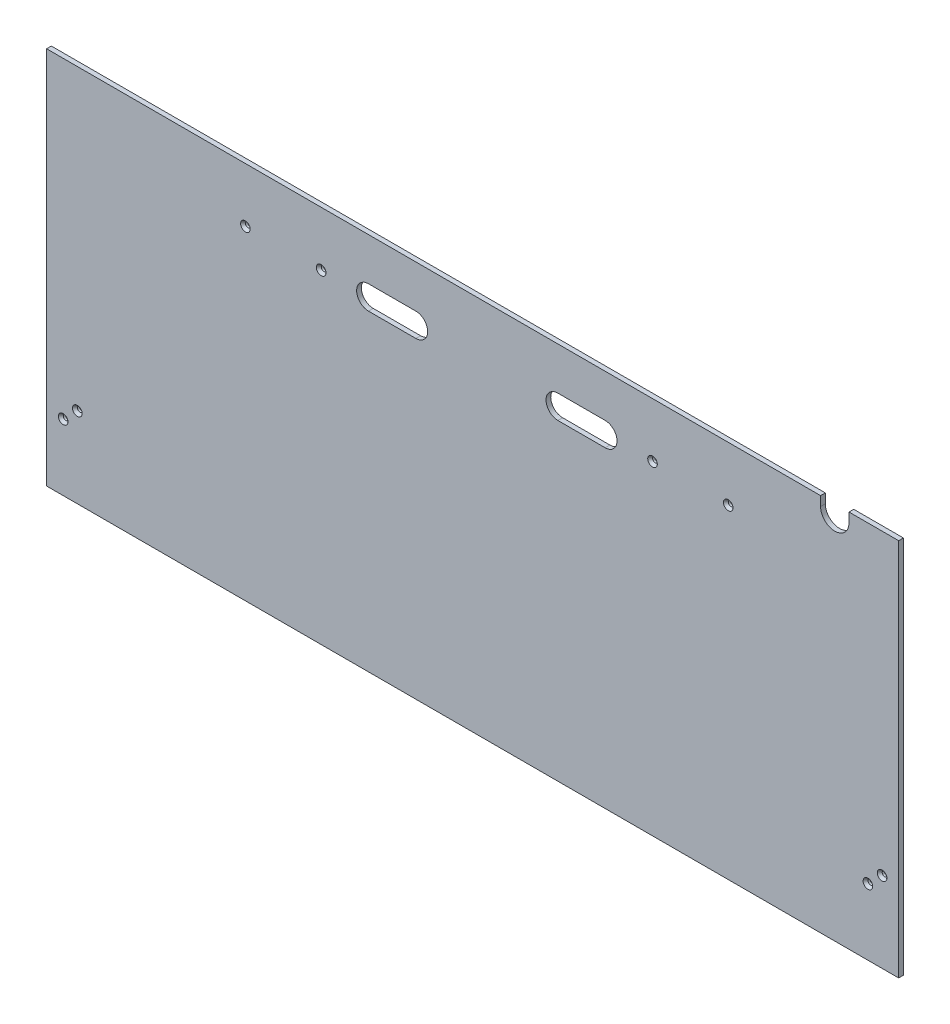
ISO-10303-21;
HEADER;
FILE_DESCRIPTION(('STEP AP214'),'2;1');
FILE_NAME('part.step','',(''),(''),'','','');
FILE_SCHEMA(('AUTOMOTIVE_DESIGN { 1 0 10303 214 1 1 1 1 }'));
ENDSEC;
DATA;
#1=APPLICATION_CONTEXT('core data for automotive mechanical design processes');
#2=APPLICATION_PROTOCOL_DEFINITION('international standard','automotive_design',2000,#1);
#3=PRODUCT_CONTEXT('',#1,'mechanical');
#4=PRODUCT('Part','Part','',(#3));
#5=PRODUCT_RELATED_PRODUCT_CATEGORY('part','',(#4));
#6=PRODUCT_DEFINITION_FORMATION('','',#4);
#7=PRODUCT_DEFINITION_CONTEXT('part definition',#1,'design');
#8=PRODUCT_DEFINITION('design','',#6,#7);
#9=PRODUCT_DEFINITION_SHAPE('','',#8);
#10=(LENGTH_UNIT() NAMED_UNIT(*) SI_UNIT(.MILLI.,.METRE.));
#11=(NAMED_UNIT(*) PLANE_ANGLE_UNIT() SI_UNIT($,.RADIAN.));
#12=(NAMED_UNIT(*) SI_UNIT($,.STERADIAN.) SOLID_ANGLE_UNIT());
#13=UNCERTAINTY_MEASURE_WITH_UNIT(LENGTH_MEASURE(1.E-05),#10,'distance_accuracy_value','');
#14=(GEOMETRIC_REPRESENTATION_CONTEXT(3) GLOBAL_UNCERTAINTY_ASSIGNED_CONTEXT((#13)) GLOBAL_UNIT_ASSIGNED_CONTEXT((#10,
#11,#12)) REPRESENTATION_CONTEXT('',''));
#15=CARTESIAN_POINT('',(0.,0.,0.));
#16=DIRECTION('',(0.,0.,1.));
#17=DIRECTION('',(1.,0.,0.));
#18=AXIS2_PLACEMENT_3D('',#15,#16,#17);
#19=CARTESIAN_POINT('',(0.,508.,6.35));
#20=DIRECTION('',(0.,-1.,0.));
#21=DIRECTION('',(0.,0.,-1.));
#22=AXIS2_PLACEMENT_3D('',#19,#20,#21);
#23=PLANE('',#22);
#24=DIRECTION('',(-1.,0.,0.));
#25=VECTOR('',#24,1.);
#26=CARTESIAN_POINT('',(0.,508.,6.35));
#27=LINE('',#26,#25);
#28=CARTESIAN_POINT('',(1038.225,508.,6.35));
#29=VERTEX_POINT('',#28);
#30=CARTESIAN_POINT('',(0.,508.,6.35));
#31=VERTEX_POINT('',#30);
#32=EDGE_CURVE('E325',#29,#31,#27,.T.);
#33=ORIENTED_EDGE('',*,*,#32,.F.);
#34=DIRECTION('',(0.,0.,1.));
#35=VECTOR('',#34,1.);
#36=CARTESIAN_POINT('',(1038.225,508.,0.));
#37=LINE('',#36,#35);
#38=CARTESIAN_POINT('',(1038.225,508.,0.));
#39=VERTEX_POINT('',#38);
#40=EDGE_CURVE('E176',#39,#29,#37,.T.);
#41=ORIENTED_EDGE('',*,*,#40,.F.);
#42=DIRECTION('',(-1.,0.,0.));
#43=VECTOR('',#42,1.);
#44=CARTESIAN_POINT('',(0.,508.,0.));
#45=LINE('',#44,#43);
#46=CARTESIAN_POINT('',(0.,508.,0.));
#47=VERTEX_POINT('',#46);
#48=EDGE_CURVE('E167',#39,#47,#45,.T.);
#49=ORIENTED_EDGE('',*,*,#48,.T.);
#50=DIRECTION('',(0.,0.,-1.));
#51=VECTOR('',#50,1.);
#52=CARTESIAN_POINT('',(0.,508.,6.35));
#53=LINE('',#52,#51);
#54=EDGE_CURVE('E329',#31,#47,#53,.T.);
#55=ORIENTED_EDGE('',*,*,#54,.F.);
#56=EDGE_LOOP('',(#33,#41,#49,#55));
#57=FACE_BOUND('',#56,.T.);
#58=ADVANCED_FACE('F33',(#57),#23,.F.);
#59=CARTESIAN_POINT('',(0.,0.,6.35));
#60=DIRECTION('',(0.,0.,-1.));
#61=DIRECTION('',(-1.,0.,0.));
#62=AXIS2_PLACEMENT_3D('',#59,#60,#61);
#63=PLANE('',#62);
#64=CARTESIAN_POINT('',(368.3,434.975,6.35));
#65=DIRECTION('',(0.,0.,1.));
#66=DIRECTION('',(1.,0.,0.));
#67=AXIS2_PLACEMENT_3D('',#64,#65,#66);
#68=CIRCLE('',#67,6.43890000000003);
#69=CARTESIAN_POINT('',(374.7389,434.975,6.35));
#70=VERTEX_POINT('',#69);
#71=EDGE_CURVE('E200',#70,#70,#68,.T.);
#72=ORIENTED_EDGE('',*,*,#71,.F.);
#73=EDGE_LOOP('',(#72));
#74=FACE_BOUND('',#73,.T.);
#75=DIRECTION('',(1.,0.,0.));
#76=VECTOR('',#75,1.);
#77=CARTESIAN_POINT('',(431.8,419.1,6.35));
#78=LINE('',#77,#76);
#79=CARTESIAN_POINT('',(431.8,419.1,6.35));
#80=VERTEX_POINT('',#79);
#81=CARTESIAN_POINT('',(495.3,419.1,6.35));
#82=VERTEX_POINT('',#81);
#83=EDGE_CURVE('E270',#80,#82,#78,.T.);
#84=ORIENTED_EDGE('',*,*,#83,.F.);
#85=CARTESIAN_POINT('',(431.8,434.975,6.35));
#86=DIRECTION('',(0.,0.,1.));
#87=DIRECTION('',(1.,0.,0.));
#88=AXIS2_PLACEMENT_3D('',#85,#86,#87);
#89=CIRCLE('',#88,15.875);
#90=CARTESIAN_POINT('',(431.8,450.85,6.35));
#91=VERTEX_POINT('',#90);
#92=EDGE_CURVE('E56',#91,#80,#89,.T.);
#93=ORIENTED_EDGE('',*,*,#92,.F.);
#94=DIRECTION('',(-1.,0.,0.));
#95=VECTOR('',#94,1.);
#96=CARTESIAN_POINT('',(431.8,450.85,6.35));
#97=LINE('',#96,#95);
#98=CARTESIAN_POINT('',(495.3,450.85,6.35));
#99=VERTEX_POINT('',#98);
#100=EDGE_CURVE('E259',#99,#91,#97,.T.);
#101=ORIENTED_EDGE('',*,*,#100,.F.);
#102=CARTESIAN_POINT('',(495.3,434.975,6.35));
#103=DIRECTION('',(0.,0.,1.));
#104=DIRECTION('',(1.,0.,0.));
#105=AXIS2_PLACEMENT_3D('',#102,#103,#104);
#106=CIRCLE('',#105,15.875);
#107=EDGE_CURVE('E274',#82,#99,#106,.T.);
#108=ORIENTED_EDGE('',*,*,#107,.F.);
#109=EDGE_LOOP('',(#84,#93,#101,#108));
#110=FACE_BOUND('',#109,.T.);
#111=DIRECTION('',(1.,0.,0.));
#112=VECTOR('',#111,1.);
#113=CARTESIAN_POINT('',(685.8,419.1,6.35));
#114=LINE('',#113,#112);
#115=CARTESIAN_POINT('',(685.8,419.1,6.35));
#116=VERTEX_POINT('',#115);
#117=CARTESIAN_POINT('',(749.3,419.1,6.35));
#118=VERTEX_POINT('',#117);
#119=EDGE_CURVE('E302',#116,#118,#114,.T.);
#120=ORIENTED_EDGE('',*,*,#119,.F.);
#121=CARTESIAN_POINT('',(685.8,434.975,6.35));
#122=DIRECTION('',(0.,0.,1.));
#123=DIRECTION('',(1.,0.,0.));
#124=AXIS2_PLACEMENT_3D('',#121,#122,#123);
#125=CIRCLE('',#124,15.875);
#126=CARTESIAN_POINT('',(685.8,450.85,6.35));
#127=VERTEX_POINT('',#126);
#128=EDGE_CURVE('E254',#127,#116,#125,.T.);
#129=ORIENTED_EDGE('',*,*,#128,.F.);
#130=DIRECTION('',(-1.,0.,0.));
#131=VECTOR('',#130,1.);
#132=CARTESIAN_POINT('',(685.8,450.85,6.35));
#133=LINE('',#132,#131);
#134=CARTESIAN_POINT('',(749.3,450.85,6.35));
#135=VERTEX_POINT('',#134);
#136=EDGE_CURVE('E291',#135,#127,#133,.T.);
#137=ORIENTED_EDGE('',*,*,#136,.F.);
#138=CARTESIAN_POINT('',(749.3,434.975,6.35));
#139=DIRECTION('',(0.,0.,1.));
#140=DIRECTION('',(1.,0.,0.));
#141=AXIS2_PLACEMENT_3D('',#138,#139,#140);
#142=CIRCLE('',#141,15.875);
#143=EDGE_CURVE('E305',#118,#135,#142,.T.);
#144=ORIENTED_EDGE('',*,*,#143,.F.);
#145=EDGE_LOOP('',(#120,#129,#137,#144));
#146=FACE_BOUND('',#145,.T.);
#147=CARTESIAN_POINT('',(1057.275,495.3,6.35));
#148=DIRECTION('',(0.,0.,1.));
#149=DIRECTION('',(-1.,0.,0.));
#150=AXIS2_PLACEMENT_3D('',#147,#148,#149);
#151=CIRCLE('',#150,19.05);
#152=CARTESIAN_POINT('',(1038.225,495.3,6.35));
#153=VERTEX_POINT('',#152);
#154=CARTESIAN_POINT('',(1076.325,495.3,6.35));
#155=VERTEX_POINT('',#154);
#156=EDGE_CURVE('E170',#153,#155,#151,.T.);
#157=ORIENTED_EDGE('',*,*,#156,.F.);
#158=DIRECTION('',(0.,-1.,0.));
#159=VECTOR('',#158,1.);
#160=CARTESIAN_POINT('',(1038.225,508.,6.35));
#161=LINE('',#160,#159);
#162=EDGE_CURVE('E152',#29,#153,#161,.T.);
#163=ORIENTED_EDGE('',*,*,#162,.F.);
#164=ORIENTED_EDGE('',*,*,#32,.T.);
#165=DIRECTION('',(0.,-1.,0.));
#166=VECTOR('',#165,1.);
#167=CARTESIAN_POINT('',(0.,0.,6.35));
#168=LINE('',#167,#166);
#169=CARTESIAN_POINT('',(0.,0.,6.35));
#170=VERTEX_POINT('',#169);
#171=EDGE_CURVE('E317',#31,#170,#168,.T.);
#172=ORIENTED_EDGE('',*,*,#171,.T.);
#173=DIRECTION('',(1.,0.,0.));
#174=VECTOR('',#173,1.);
#175=CARTESIAN_POINT('',(0.,0.,6.35));
#176=LINE('',#175,#174);
#177=CARTESIAN_POINT('',(1143.,0.,6.35));
#178=VERTEX_POINT('',#177);
#179=EDGE_CURVE('E320',#170,#178,#176,.T.);
#180=ORIENTED_EDGE('',*,*,#179,.T.);
#181=DIRECTION('',(0.,1.,0.));
#182=VECTOR('',#181,1.);
#183=CARTESIAN_POINT('',(1143.,0.,6.35));
#184=LINE('',#183,#182);
#185=CARTESIAN_POINT('',(1143.,508.,6.35));
#186=VERTEX_POINT('',#185);
#187=EDGE_CURVE('E323',#178,#186,#184,.T.);
#188=ORIENTED_EDGE('',*,*,#187,.T.);
#189=CARTESIAN_POINT('',(1076.325,508.,6.35));
#190=VERTEX_POINT('',#189);
#191=EDGE_CURVE('E326',#186,#190,#27,.T.);
#192=ORIENTED_EDGE('',*,*,#191,.T.);
#193=DIRECTION('',(0.,1.,0.));
#194=VECTOR('',#193,1.);
#195=CARTESIAN_POINT('',(1076.325,508.,6.35));
#196=LINE('',#195,#194);
#197=EDGE_CURVE('E168',#155,#190,#196,.T.);
#198=ORIENTED_EDGE('',*,*,#197,.F.);
#199=EDGE_LOOP('',(#157,#163,#164,#172,#180,#188,#192,#198));
#200=FACE_BOUND('',#199,.T.);
#201=CARTESIAN_POINT('',(22.2249999999999,88.9,6.35));
#202=DIRECTION('',(0.,0.,1.));
#203=DIRECTION('',(1.,0.,0.));
#204=AXIS2_PLACEMENT_3D('',#201,#202,#203);
#205=CIRCLE('',#204,6.4389);
#206=CARTESIAN_POINT('',(28.6638999999999,88.9,6.35));
#207=VERTEX_POINT('',#206);
#208=EDGE_CURVE('E245',#207,#207,#205,.T.);
#209=ORIENTED_EDGE('',*,*,#208,.F.);
#210=EDGE_LOOP('',(#209));
#211=FACE_BOUND('',#210,.T.);
#212=CARTESIAN_POINT('',(41.2749999999999,107.95,6.35));
#213=DIRECTION('',(0.,0.,1.));
#214=DIRECTION('',(1.,0.,0.));
#215=AXIS2_PLACEMENT_3D('',#212,#213,#214);
#216=CIRCLE('',#215,6.4389);
#217=CARTESIAN_POINT('',(47.7138999999999,107.95,6.35));
#218=VERTEX_POINT('',#217);
#219=EDGE_CURVE('E236',#218,#218,#216,.T.);
#220=ORIENTED_EDGE('',*,*,#219,.F.);
#221=EDGE_LOOP('',(#220));
#222=FACE_BOUND('',#221,.T.);
#223=CARTESIAN_POINT('',(1101.725,88.9,6.35));
#224=DIRECTION('',(0.,0.,1.));
#225=DIRECTION('',(1.,0.,0.));
#226=AXIS2_PLACEMENT_3D('',#223,#224,#225);
#227=CIRCLE('',#226,6.43890000000003);
#228=CARTESIAN_POINT('',(1108.1639,88.9,6.35));
#229=VERTEX_POINT('',#228);
#230=EDGE_CURVE('E227',#229,#229,#227,.T.);
#231=ORIENTED_EDGE('',*,*,#230,.F.);
#232=EDGE_LOOP('',(#231));
#233=FACE_BOUND('',#232,.T.);
#234=CARTESIAN_POINT('',(1120.775,107.95,6.35));
#235=DIRECTION('',(0.,0.,1.));
#236=DIRECTION('',(1.,0.,0.));
#237=AXIS2_PLACEMENT_3D('',#234,#235,#236);
#238=CIRCLE('',#237,6.43890000000003);
#239=CARTESIAN_POINT('',(1127.2139,107.95,6.35));
#240=VERTEX_POINT('',#239);
#241=EDGE_CURVE('E218',#240,#240,#238,.T.);
#242=ORIENTED_EDGE('',*,*,#241,.F.);
#243=EDGE_LOOP('',(#242));
#244=FACE_BOUND('',#243,.T.);
#245=CARTESIAN_POINT('',(266.7,434.975,6.35));
#246=DIRECTION('',(0.,0.,1.));
#247=DIRECTION('',(1.,0.,0.));
#248=AXIS2_PLACEMENT_3D('',#245,#246,#247);
#249=CIRCLE('',#248,6.43890000000003);
#250=CARTESIAN_POINT('',(273.1389,434.975,6.35));
#251=VERTEX_POINT('',#250);
#252=EDGE_CURVE('E209',#251,#251,#249,.T.);
#253=ORIENTED_EDGE('',*,*,#252,.F.);
#254=EDGE_LOOP('',(#253));
#255=FACE_BOUND('',#254,.T.);
#256=CARTESIAN_POINT('',(812.8,434.975,6.35));
#257=DIRECTION('',(0.,0.,1.));
#258=DIRECTION('',(1.,0.,0.));
#259=AXIS2_PLACEMENT_3D('',#256,#257,#258);
#260=CIRCLE('',#259,6.43890000000003);
#261=CARTESIAN_POINT('',(819.2389,434.975,6.35));
#262=VERTEX_POINT('',#261);
#263=EDGE_CURVE('E191',#262,#262,#260,.T.);
#264=ORIENTED_EDGE('',*,*,#263,.F.);
#265=EDGE_LOOP('',(#264));
#266=FACE_BOUND('',#265,.T.);
#267=CARTESIAN_POINT('',(914.4,434.975,6.35));
#268=DIRECTION('',(0.,0.,1.));
#269=DIRECTION('',(1.,0.,0.));
#270=AXIS2_PLACEMENT_3D('',#267,#268,#269);
#271=CIRCLE('',#270,6.43890000000003);
#272=CARTESIAN_POINT('',(920.8389,434.975,6.35));
#273=VERTEX_POINT('',#272);
#274=EDGE_CURVE('E178',#273,#273,#271,.T.);
#275=ORIENTED_EDGE('',*,*,#274,.F.);
#276=EDGE_LOOP('',(#275));
#277=FACE_BOUND('',#276,.T.);
#278=ADVANCED_FACE('F356',(#74,#110,#146,#200,#211,#222,#233,#244,#255,#266,#277),#63,.F.);
#279=CARTESIAN_POINT('',(0.,0.,6.35));
#280=DIRECTION('',(1.,0.,0.));
#281=DIRECTION('',(0.,0.,-1.));
#282=AXIS2_PLACEMENT_3D('',#279,#280,#281);
#283=PLANE('',#282);
#284=DIRECTION('',(0.,-1.,0.));
#285=VECTOR('',#284,1.);
#286=CARTESIAN_POINT('',(0.,0.,0.));
#287=LINE('',#286,#285);
#288=CARTESIAN_POINT('',(0.,0.,0.));
#289=VERTEX_POINT('',#288);
#290=EDGE_CURVE('E281',#47,#289,#287,.T.);
#291=ORIENTED_EDGE('',*,*,#290,.T.);
#292=DIRECTION('',(0.,0.,-1.));
#293=VECTOR('',#292,1.);
#294=CARTESIAN_POINT('',(0.,0.,6.35));
#295=LINE('',#294,#293);
#296=EDGE_CURVE('E11',#170,#289,#295,.T.);
#297=ORIENTED_EDGE('',*,*,#296,.F.);
#298=ORIENTED_EDGE('',*,*,#171,.F.);
#299=ORIENTED_EDGE('',*,*,#54,.T.);
#300=EDGE_LOOP('',(#291,#297,#298,#299));
#301=FACE_BOUND('',#300,.T.);
#302=ADVANCED_FACE('F35',(#301),#283,.F.);
#303=CARTESIAN_POINT('',(0.,0.,6.35));
#304=DIRECTION('',(0.,1.,0.));
#305=DIRECTION('',(0.,0.,1.));
#306=AXIS2_PLACEMENT_3D('',#303,#304,#305);
#307=PLANE('',#306);
#308=DIRECTION('',(1.,0.,0.));
#309=VECTOR('',#308,1.);
#310=CARTESIAN_POINT('',(0.,0.,0.));
#311=LINE('',#310,#309);
#312=CARTESIAN_POINT('',(1143.,0.,0.));
#313=VERTEX_POINT('',#312);
#314=EDGE_CURVE('E332',#289,#313,#311,.T.);
#315=ORIENTED_EDGE('',*,*,#314,.T.);
#316=DIRECTION('',(0.,0.,-1.));
#317=VECTOR('',#316,1.);
#318=CARTESIAN_POINT('',(1143.,0.,6.35));
#319=LINE('',#318,#317);
#320=EDGE_CURVE('E41',#178,#313,#319,.T.);
#321=ORIENTED_EDGE('',*,*,#320,.F.);
#322=ORIENTED_EDGE('',*,*,#179,.F.);
#323=ORIENTED_EDGE('',*,*,#296,.T.);
#324=EDGE_LOOP('',(#315,#321,#322,#323));
#325=FACE_BOUND('',#324,.T.);
#326=ADVANCED_FACE('F360',(#325),#307,.F.);
#327=CARTESIAN_POINT('',(1143.,0.,6.35));
#328=DIRECTION('',(-1.,0.,0.));
#329=DIRECTION('',(0.,0.,1.));
#330=AXIS2_PLACEMENT_3D('',#327,#328,#329);
#331=PLANE('',#330);
#332=DIRECTION('',(0.,1.,0.));
#333=VECTOR('',#332,1.);
#334=CARTESIAN_POINT('',(1143.,0.,0.));
#335=LINE('',#334,#333);
#336=CARTESIAN_POINT('',(1143.,508.,0.));
#337=VERTEX_POINT('',#336);
#338=EDGE_CURVE('E334',#313,#337,#335,.T.);
#339=ORIENTED_EDGE('',*,*,#338,.T.);
#340=DIRECTION('',(0.,0.,-1.));
#341=VECTOR('',#340,1.);
#342=CARTESIAN_POINT('',(1143.,508.,6.35));
#343=LINE('',#342,#341);
#344=EDGE_CURVE('E340',#186,#337,#343,.T.);
#345=ORIENTED_EDGE('',*,*,#344,.F.);
#346=ORIENTED_EDGE('',*,*,#187,.F.);
#347=ORIENTED_EDGE('',*,*,#320,.T.);
#348=EDGE_LOOP('',(#339,#345,#346,#347));
#349=FACE_BOUND('',#348,.T.);
#350=ADVANCED_FACE('F347',(#349),#331,.F.);
#351=CARTESIAN_POINT('',(1076.325,508.,0.));
#352=VERTEX_POINT('',#351);
#353=EDGE_CURVE('E321',#337,#352,#45,.T.);
#354=ORIENTED_EDGE('',*,*,#353,.T.);
#355=DIRECTION('',(0.,0.,1.));
#356=VECTOR('',#355,1.);
#357=CARTESIAN_POINT('',(1076.325,508.,0.));
#358=LINE('',#357,#356);
#359=EDGE_CURVE('E179',#352,#190,#358,.T.);
#360=ORIENTED_EDGE('',*,*,#359,.T.);
#361=ORIENTED_EDGE('',*,*,#191,.F.);
#362=ORIENTED_EDGE('',*,*,#344,.T.);
#363=EDGE_LOOP('',(#354,#360,#361,#362));
#364=FACE_BOUND('',#363,.T.);
#365=ADVANCED_FACE('F352',(#364),#23,.F.);
#366=CARTESIAN_POINT('',(0.,0.,0.));
#367=DIRECTION('',(0.,0.,-1.));
#368=DIRECTION('',(-1.,0.,0.));
#369=AXIS2_PLACEMENT_3D('',#366,#367,#368);
#370=PLANE('',#369);
#371=DIRECTION('',(0.,-1.,0.));
#372=VECTOR('',#371,1.);
#373=CARTESIAN_POINT('',(1038.225,508.,0.));
#374=LINE('',#373,#372);
#375=CARTESIAN_POINT('',(1038.225,495.3,0.));
#376=VERTEX_POINT('',#375);
#377=EDGE_CURVE('E149',#39,#376,#374,.T.);
#378=ORIENTED_EDGE('',*,*,#377,.T.);
#379=CARTESIAN_POINT('',(1057.275,495.3,0.));
#380=DIRECTION('',(0.,0.,1.));
#381=DIRECTION('',(-1.,0.,0.));
#382=AXIS2_PLACEMENT_3D('',#379,#380,#381);
#383=CIRCLE('',#382,19.05);
#384=CARTESIAN_POINT('',(1076.325,495.3,0.));
#385=VERTEX_POINT('',#384);
#386=EDGE_CURVE('E159',#376,#385,#383,.T.);
#387=ORIENTED_EDGE('',*,*,#386,.T.);
#388=DIRECTION('',(0.,1.,0.));
#389=VECTOR('',#388,1.);
#390=CARTESIAN_POINT('',(1076.325,508.,0.));
#391=LINE('',#390,#389);
#392=EDGE_CURVE('E48',#385,#352,#391,.T.);
#393=ORIENTED_EDGE('',*,*,#392,.T.);
#394=ORIENTED_EDGE('',*,*,#353,.F.);
#395=ORIENTED_EDGE('',*,*,#338,.F.);
#396=ORIENTED_EDGE('',*,*,#314,.F.);
#397=ORIENTED_EDGE('',*,*,#290,.F.);
#398=ORIENTED_EDGE('',*,*,#48,.F.);
#399=EDGE_LOOP('',(#378,#387,#393,#394,#395,#396,#397,#398));
#400=FACE_BOUND('',#399,.T.);
#401=CARTESIAN_POINT('',(914.4,434.975,0.));
#402=DIRECTION('',(0.,0.,-1.));
#403=DIRECTION('',(-1.,0.,0.));
#404=AXIS2_PLACEMENT_3D('',#401,#402,#403);
#405=CIRCLE('',#404,3.3782);
#406=CARTESIAN_POINT('',(911.0218,434.975,0.));
#407=VERTEX_POINT('',#406);
#408=EDGE_CURVE('E188',#407,#407,#405,.T.);
#409=ORIENTED_EDGE('',*,*,#408,.F.);
#410=EDGE_LOOP('',(#409));
#411=FACE_BOUND('',#410,.T.);
#412=CARTESIAN_POINT('',(812.8,434.975,0.));
#413=DIRECTION('',(0.,0.,-1.));
#414=DIRECTION('',(-1.,0.,0.));
#415=AXIS2_PLACEMENT_3D('',#412,#413,#414);
#416=CIRCLE('',#415,3.3782);
#417=CARTESIAN_POINT('',(809.4218,434.975,0.));
#418=VERTEX_POINT('',#417);
#419=EDGE_CURVE('E197',#418,#418,#416,.T.);
#420=ORIENTED_EDGE('',*,*,#419,.F.);
#421=EDGE_LOOP('',(#420));
#422=FACE_BOUND('',#421,.T.);
#423=CARTESIAN_POINT('',(368.3,434.975,0.));
#424=DIRECTION('',(0.,0.,-1.));
#425=DIRECTION('',(-1.,0.,0.));
#426=AXIS2_PLACEMENT_3D('',#423,#424,#425);
#427=CIRCLE('',#426,3.3782);
#428=CARTESIAN_POINT('',(364.9218,434.975,0.));
#429=VERTEX_POINT('',#428);
#430=EDGE_CURVE('E206',#429,#429,#427,.T.);
#431=ORIENTED_EDGE('',*,*,#430,.F.);
#432=EDGE_LOOP('',(#431));
#433=FACE_BOUND('',#432,.T.);
#434=CARTESIAN_POINT('',(266.7,434.975,0.));
#435=DIRECTION('',(0.,0.,-1.));
#436=DIRECTION('',(-1.,0.,0.));
#437=AXIS2_PLACEMENT_3D('',#434,#435,#436);
#438=CIRCLE('',#437,3.3782);
#439=CARTESIAN_POINT('',(263.3218,434.975,0.));
#440=VERTEX_POINT('',#439);
#441=EDGE_CURVE('E215',#440,#440,#438,.T.);
#442=ORIENTED_EDGE('',*,*,#441,.F.);
#443=EDGE_LOOP('',(#442));
#444=FACE_BOUND('',#443,.T.);
#445=CARTESIAN_POINT('',(1120.775,107.95,0.));
#446=DIRECTION('',(0.,0.,-1.));
#447=DIRECTION('',(-1.,0.,0.));
#448=AXIS2_PLACEMENT_3D('',#445,#446,#447);
#449=CIRCLE('',#448,3.3782);
#450=CARTESIAN_POINT('',(1117.3968,107.95,0.));
#451=VERTEX_POINT('',#450);
#452=EDGE_CURVE('E224',#451,#451,#449,.T.);
#453=ORIENTED_EDGE('',*,*,#452,.F.);
#454=EDGE_LOOP('',(#453));
#455=FACE_BOUND('',#454,.T.);
#456=CARTESIAN_POINT('',(1101.725,88.9,0.));
#457=DIRECTION('',(0.,0.,-1.));
#458=DIRECTION('',(-1.,0.,0.));
#459=AXIS2_PLACEMENT_3D('',#456,#457,#458);
#460=CIRCLE('',#459,3.3782);
#461=CARTESIAN_POINT('',(1098.3468,88.9,0.));
#462=VERTEX_POINT('',#461);
#463=EDGE_CURVE('E233',#462,#462,#460,.T.);
#464=ORIENTED_EDGE('',*,*,#463,.F.);
#465=EDGE_LOOP('',(#464));
#466=FACE_BOUND('',#465,.T.);
#467=CARTESIAN_POINT('',(41.2749999999999,107.95,0.));
#468=DIRECTION('',(0.,0.,-1.));
#469=DIRECTION('',(-1.,0.,0.));
#470=AXIS2_PLACEMENT_3D('',#467,#468,#469);
#471=CIRCLE('',#470,3.3782);
#472=CARTESIAN_POINT('',(37.8968,107.95,0.));
#473=VERTEX_POINT('',#472);
#474=EDGE_CURVE('E242',#473,#473,#471,.T.);
#475=ORIENTED_EDGE('',*,*,#474,.F.);
#476=EDGE_LOOP('',(#475));
#477=FACE_BOUND('',#476,.T.);
#478=CARTESIAN_POINT('',(22.2249999999999,88.9,0.));
#479=DIRECTION('',(0.,0.,-1.));
#480=DIRECTION('',(-1.,0.,0.));
#481=AXIS2_PLACEMENT_3D('',#478,#479,#480);
#482=CIRCLE('',#481,3.3782);
#483=CARTESIAN_POINT('',(18.8467999999999,88.9,0.));
#484=VERTEX_POINT('',#483);
#485=EDGE_CURVE('E251',#484,#484,#482,.T.);
#486=ORIENTED_EDGE('',*,*,#485,.F.);
#487=EDGE_LOOP('',(#486));
#488=FACE_BOUND('',#487,.T.);
#489=CARTESIAN_POINT('',(431.8,434.975,0.));
#490=DIRECTION('',(0.,0.,1.));
#491=DIRECTION('',(1.,0.,0.));
#492=AXIS2_PLACEMENT_3D('',#489,#490,#491);
#493=CIRCLE('',#492,15.875);
#494=CARTESIAN_POINT('',(431.8,450.85,0.));
#495=VERTEX_POINT('',#494);
#496=CARTESIAN_POINT('',(431.8,419.1,0.));
#497=VERTEX_POINT('',#496);
#498=EDGE_CURVE('E255',#495,#497,#493,.T.);
#499=ORIENTED_EDGE('',*,*,#498,.T.);
#500=DIRECTION('',(1.,0.,0.));
#501=VECTOR('',#500,1.);
#502=CARTESIAN_POINT('',(431.8,419.1,0.));
#503=LINE('',#502,#501);
#504=CARTESIAN_POINT('',(495.3,419.1,0.));
#505=VERTEX_POINT('',#504);
#506=EDGE_CURVE('E258',#497,#505,#503,.T.);
#507=ORIENTED_EDGE('',*,*,#506,.T.);
#508=CARTESIAN_POINT('',(495.3,434.975,0.));
#509=DIRECTION('',(0.,0.,1.));
#510=DIRECTION('',(1.,0.,0.));
#511=AXIS2_PLACEMENT_3D('',#508,#509,#510);
#512=CIRCLE('',#511,15.875);
#513=CARTESIAN_POINT('',(495.3,450.85,0.));
#514=VERTEX_POINT('',#513);
#515=EDGE_CURVE('E262',#505,#514,#512,.T.);
#516=ORIENTED_EDGE('',*,*,#515,.T.);
#517=DIRECTION('',(-1.,0.,0.));
#518=VECTOR('',#517,1.);
#519=CARTESIAN_POINT('',(431.8,450.85,0.));
#520=LINE('',#519,#518);
#521=EDGE_CURVE('E265',#514,#495,#520,.T.);
#522=ORIENTED_EDGE('',*,*,#521,.T.);
#523=EDGE_LOOP('',(#499,#507,#516,#522));
#524=FACE_BOUND('',#523,.T.);
#525=CARTESIAN_POINT('',(685.8,434.975,0.));
#526=DIRECTION('',(0.,0.,1.));
#527=DIRECTION('',(1.,0.,0.));
#528=AXIS2_PLACEMENT_3D('',#525,#526,#527);
#529=CIRCLE('',#528,15.875);
#530=CARTESIAN_POINT('',(685.8,450.85,0.));
#531=VERTEX_POINT('',#530);
#532=CARTESIAN_POINT('',(685.8,419.1,0.));
#533=VERTEX_POINT('',#532);
#534=EDGE_CURVE('E287',#531,#533,#529,.T.);
#535=ORIENTED_EDGE('',*,*,#534,.T.);
#536=DIRECTION('',(1.,0.,0.));
#537=VECTOR('',#536,1.);
#538=CARTESIAN_POINT('',(685.8,419.1,0.));
#539=LINE('',#538,#537);
#540=CARTESIAN_POINT('',(749.3,419.1,0.));
#541=VERTEX_POINT('',#540);
#542=EDGE_CURVE('E290',#533,#541,#539,.T.);
#543=ORIENTED_EDGE('',*,*,#542,.T.);
#544=CARTESIAN_POINT('',(749.3,434.975,0.));
#545=DIRECTION('',(0.,0.,1.));
#546=DIRECTION('',(1.,0.,0.));
#547=AXIS2_PLACEMENT_3D('',#544,#545,#546);
#548=CIRCLE('',#547,15.875);
#549=CARTESIAN_POINT('',(749.3,450.85,0.));
#550=VERTEX_POINT('',#549);
#551=EDGE_CURVE('E294',#541,#550,#548,.T.);
#552=ORIENTED_EDGE('',*,*,#551,.T.);
#553=DIRECTION('',(-1.,0.,0.));
#554=VECTOR('',#553,1.);
#555=CARTESIAN_POINT('',(685.8,450.85,0.));
#556=LINE('',#555,#554);
#557=EDGE_CURVE('E297',#550,#531,#556,.T.);
#558=ORIENTED_EDGE('',*,*,#557,.T.);
#559=EDGE_LOOP('',(#535,#543,#552,#558));
#560=FACE_BOUND('',#559,.T.);
#561=ADVANCED_FACE('F164',(#400,#411,#422,#433,#444,#455,#466,#477,#488,#524,#560),#370,.T.);
#562=CARTESIAN_POINT('',(685.8,434.975,0.));
#563=DIRECTION('',(0.,0.,1.));
#564=DIRECTION('',(1.,0.,0.));
#565=AXIS2_PLACEMENT_3D('',#562,#563,#564);
#566=CYLINDRICAL_SURFACE('',#565,15.875);
#567=ORIENTED_EDGE('',*,*,#128,.T.);
#568=DIRECTION('',(0.,0.,1.));
#569=VECTOR('',#568,1.);
#570=CARTESIAN_POINT('',(685.8,419.1,0.));
#571=LINE('',#570,#569);
#572=EDGE_CURVE('E300',#533,#116,#571,.T.);
#573=ORIENTED_EDGE('',*,*,#572,.F.);
#574=ORIENTED_EDGE('',*,*,#534,.F.);
#575=DIRECTION('',(0.,0.,1.));
#576=VECTOR('',#575,1.);
#577=CARTESIAN_POINT('',(685.8,450.85,0.));
#578=LINE('',#577,#576);
#579=EDGE_CURVE('E271',#531,#127,#578,.T.);
#580=ORIENTED_EDGE('',*,*,#579,.T.);
#581=EDGE_LOOP('',(#567,#573,#574,#580));
#582=FACE_BOUND('',#581,.T.);
#583=ADVANCED_FACE('F379',(#582),#566,.F.);
#584=CARTESIAN_POINT('',(685.8,450.85,0.));
#585=DIRECTION('',(0.,1.,0.));
#586=DIRECTION('',(0.,0.,1.));
#587=AXIS2_PLACEMENT_3D('',#584,#585,#586);
#588=PLANE('',#587);
#589=ORIENTED_EDGE('',*,*,#136,.T.);
#590=ORIENTED_EDGE('',*,*,#579,.F.);
#591=ORIENTED_EDGE('',*,*,#557,.F.);
#592=DIRECTION('',(0.,0.,1.));
#593=VECTOR('',#592,1.);
#594=CARTESIAN_POINT('',(749.3,450.85,0.));
#595=LINE('',#594,#593);
#596=EDGE_CURVE('E311',#550,#135,#595,.T.);
#597=ORIENTED_EDGE('',*,*,#596,.T.);
#598=EDGE_LOOP('',(#589,#590,#591,#597));
#599=FACE_BOUND('',#598,.T.);
#600=ADVANCED_FACE('F520',(#599),#588,.F.);
#601=CARTESIAN_POINT('',(749.3,434.975,0.));
#602=DIRECTION('',(0.,0.,1.));
#603=DIRECTION('',(1.,0.,0.));
#604=AXIS2_PLACEMENT_3D('',#601,#602,#603);
#605=CYLINDRICAL_SURFACE('',#604,15.875);
#606=ORIENTED_EDGE('',*,*,#143,.T.);
#607=ORIENTED_EDGE('',*,*,#596,.F.);
#608=ORIENTED_EDGE('',*,*,#551,.F.);
#609=DIRECTION('',(0.,0.,1.));
#610=VECTOR('',#609,1.);
#611=CARTESIAN_POINT('',(749.3,419.1,0.));
#612=LINE('',#611,#610);
#613=EDGE_CURVE('E313',#541,#118,#612,.T.);
#614=ORIENTED_EDGE('',*,*,#613,.T.);
#615=EDGE_LOOP('',(#606,#607,#608,#614));
#616=FACE_BOUND('',#615,.T.);
#617=ADVANCED_FACE('F523',(#616),#605,.F.);
#618=CARTESIAN_POINT('',(685.8,419.1,0.));
#619=DIRECTION('',(0.,-1.,0.));
#620=DIRECTION('',(0.,0.,-1.));
#621=AXIS2_PLACEMENT_3D('',#618,#619,#620);
#622=PLANE('',#621);
#623=ORIENTED_EDGE('',*,*,#119,.T.);
#624=ORIENTED_EDGE('',*,*,#613,.F.);
#625=ORIENTED_EDGE('',*,*,#542,.F.);
#626=ORIENTED_EDGE('',*,*,#572,.T.);
#627=EDGE_LOOP('',(#623,#624,#625,#626));
#628=FACE_BOUND('',#627,.T.);
#629=ADVANCED_FACE('F519',(#628),#622,.F.);
#630=CARTESIAN_POINT('',(431.8,434.975,0.));
#631=DIRECTION('',(0.,0.,1.));
#632=DIRECTION('',(1.,0.,0.));
#633=AXIS2_PLACEMENT_3D('',#630,#631,#632);
#634=CYLINDRICAL_SURFACE('',#633,15.875);
#635=ORIENTED_EDGE('',*,*,#92,.T.);
#636=DIRECTION('',(0.,0.,1.));
#637=VECTOR('',#636,1.);
#638=CARTESIAN_POINT('',(431.8,419.1,0.));
#639=LINE('',#638,#637);
#640=EDGE_CURVE('E268',#497,#80,#639,.T.);
#641=ORIENTED_EDGE('',*,*,#640,.F.);
#642=ORIENTED_EDGE('',*,*,#498,.F.);
#643=DIRECTION('',(0.,0.,1.));
#644=VECTOR('',#643,1.);
#645=CARTESIAN_POINT('',(431.8,450.85,0.));
#646=LINE('',#645,#644);
#647=EDGE_CURVE('E279',#495,#91,#646,.T.);
#648=ORIENTED_EDGE('',*,*,#647,.T.);
#649=EDGE_LOOP('',(#635,#641,#642,#648));
#650=FACE_BOUND('',#649,.T.);
#651=ADVANCED_FACE('F509',(#650),#634,.F.);
#652=CARTESIAN_POINT('',(431.8,450.85,0.));
#653=DIRECTION('',(0.,1.,0.));
#654=DIRECTION('',(0.,0.,1.));
#655=AXIS2_PLACEMENT_3D('',#652,#653,#654);
#656=PLANE('',#655);
#657=ORIENTED_EDGE('',*,*,#100,.T.);
#658=ORIENTED_EDGE('',*,*,#647,.F.);
#659=ORIENTED_EDGE('',*,*,#521,.F.);
#660=DIRECTION('',(0.,0.,1.));
#661=VECTOR('',#660,1.);
#662=CARTESIAN_POINT('',(495.3,450.85,0.));
#663=LINE('',#662,#661);
#664=EDGE_CURVE('E282',#514,#99,#663,.T.);
#665=ORIENTED_EDGE('',*,*,#664,.T.);
#666=EDGE_LOOP('',(#657,#658,#659,#665));
#667=FACE_BOUND('',#666,.T.);
#668=ADVANCED_FACE('F505',(#667),#656,.F.);
#669=CARTESIAN_POINT('',(495.3,434.975,0.));
#670=DIRECTION('',(0.,0.,1.));
#671=DIRECTION('',(1.,0.,0.));
#672=AXIS2_PLACEMENT_3D('',#669,#670,#671);
#673=CYLINDRICAL_SURFACE('',#672,15.875);
#674=ORIENTED_EDGE('',*,*,#107,.T.);
#675=ORIENTED_EDGE('',*,*,#664,.F.);
#676=ORIENTED_EDGE('',*,*,#515,.F.);
#677=DIRECTION('',(0.,0.,1.));
#678=VECTOR('',#677,1.);
#679=CARTESIAN_POINT('',(495.3,419.1,0.));
#680=LINE('',#679,#678);
#681=EDGE_CURVE('E284',#505,#82,#680,.T.);
#682=ORIENTED_EDGE('',*,*,#681,.T.);
#683=EDGE_LOOP('',(#674,#675,#676,#682));
#684=FACE_BOUND('',#683,.T.);
#685=ADVANCED_FACE('F508',(#684),#673,.F.);
#686=CARTESIAN_POINT('',(431.8,419.1,0.));
#687=DIRECTION('',(0.,-1.,0.));
#688=DIRECTION('',(0.,0.,-1.));
#689=AXIS2_PLACEMENT_3D('',#686,#687,#688);
#690=PLANE('',#689);
#691=ORIENTED_EDGE('',*,*,#83,.T.);
#692=ORIENTED_EDGE('',*,*,#681,.F.);
#693=ORIENTED_EDGE('',*,*,#506,.F.);
#694=ORIENTED_EDGE('',*,*,#640,.T.);
#695=EDGE_LOOP('',(#691,#692,#693,#694));
#696=FACE_BOUND('',#695,.T.);
#697=ADVANCED_FACE('F503',(#696),#690,.F.);
#698=CARTESIAN_POINT('',(22.2249999999999,88.9,6.35));
#699=DIRECTION('',(0.,0.,1.));
#700=DIRECTION('',(1.,0.,0.));
#701=AXIS2_PLACEMENT_3D('',#698,#699,#700);
#702=CYLINDRICAL_SURFACE('',#701,3.3782);
#703=CARTESIAN_POINT('',(22.2249999999999,88.9,2.82906741601866));
#704=DIRECTION('',(0.,0.,1.));
#705=DIRECTION('',(1.,0.,0.));
#706=AXIS2_PLACEMENT_3D('',#703,#704,#705);
#707=CIRCLE('',#706,3.3782);
#708=CARTESIAN_POINT('',(25.6031999999999,88.9,2.82906741601866));
#709=VERTEX_POINT('',#708);
#710=EDGE_CURVE('E248',#709,#709,#707,.T.);
#711=ORIENTED_EDGE('',*,*,#710,.T.);
#712=EDGE_LOOP('',(#711));
#713=FACE_BOUND('',#712,.T.);
#714=ORIENTED_EDGE('',*,*,#485,.T.);
#715=EDGE_LOOP('',(#714));
#716=FACE_BOUND('',#715,.T.);
#717=ADVANCED_FACE('F499',(#713,#716),#702,.F.);
#718=CARTESIAN_POINT('',(22.2249999999999,88.9,6.35));
#719=DIRECTION('',(0.,0.,1.));
#720=DIRECTION('',(1.,0.,0.));
#721=AXIS2_PLACEMENT_3D('',#718,#719,#720);
#722=CONICAL_SURFACE('',#721,6.4389,0.715584993317677);
#723=ORIENTED_EDGE('',*,*,#710,.F.);
#724=EDGE_LOOP('',(#723));
#725=FACE_BOUND('',#724,.T.);
#726=ORIENTED_EDGE('',*,*,#208,.T.);
#727=EDGE_LOOP('',(#726));
#728=FACE_BOUND('',#727,.T.);
#729=ADVANCED_FACE('F495',(#725,#728),#722,.F.);
#730=CARTESIAN_POINT('',(41.2749999999999,107.95,6.35));
#731=DIRECTION('',(0.,0.,1.));
#732=DIRECTION('',(1.,0.,0.));
#733=AXIS2_PLACEMENT_3D('',#730,#731,#732);
#734=CYLINDRICAL_SURFACE('',#733,3.3782);
#735=CARTESIAN_POINT('',(41.2749999999999,107.95,2.82906741601866));
#736=DIRECTION('',(0.,0.,1.));
#737=DIRECTION('',(1.,0.,0.));
#738=AXIS2_PLACEMENT_3D('',#735,#736,#737);
#739=CIRCLE('',#738,3.3782);
#740=CARTESIAN_POINT('',(44.6531999999999,107.95,2.82906741601866));
#741=VERTEX_POINT('',#740);
#742=EDGE_CURVE('E239',#741,#741,#739,.T.);
#743=ORIENTED_EDGE('',*,*,#742,.T.);
#744=EDGE_LOOP('',(#743));
#745=FACE_BOUND('',#744,.T.);
#746=ORIENTED_EDGE('',*,*,#474,.T.);
#747=EDGE_LOOP('',(#746));
#748=FACE_BOUND('',#747,.T.);
#749=ADVANCED_FACE('F491',(#745,#748),#734,.F.);
#750=CARTESIAN_POINT('',(41.2749999999999,107.95,6.35));
#751=DIRECTION('',(0.,0.,1.));
#752=DIRECTION('',(1.,0.,0.));
#753=AXIS2_PLACEMENT_3D('',#750,#751,#752);
#754=CONICAL_SURFACE('',#753,6.4389,0.715584993317676);
#755=ORIENTED_EDGE('',*,*,#742,.F.);
#756=EDGE_LOOP('',(#755));
#757=FACE_BOUND('',#756,.T.);
#758=ORIENTED_EDGE('',*,*,#219,.T.);
#759=EDGE_LOOP('',(#758));
#760=FACE_BOUND('',#759,.T.);
#761=ADVANCED_FACE('F487',(#757,#760),#754,.F.);
#762=CARTESIAN_POINT('',(1101.725,88.9,6.35));
#763=DIRECTION('',(0.,0.,1.));
#764=DIRECTION('',(1.,0.,0.));
#765=AXIS2_PLACEMENT_3D('',#762,#763,#764);
#766=CYLINDRICAL_SURFACE('',#765,3.3782);
#767=CARTESIAN_POINT('',(1101.725,88.9,2.82906741601866));
#768=DIRECTION('',(0.,0.,1.));
#769=DIRECTION('',(1.,0.,0.));
#770=AXIS2_PLACEMENT_3D('',#767,#768,#769);
#771=CIRCLE('',#770,3.3782);
#772=CARTESIAN_POINT('',(1105.1032,88.9,2.82906741601866));
#773=VERTEX_POINT('',#772);
#774=EDGE_CURVE('E230',#773,#773,#771,.T.);
#775=ORIENTED_EDGE('',*,*,#774,.T.);
#776=EDGE_LOOP('',(#775));
#777=FACE_BOUND('',#776,.T.);
#778=ORIENTED_EDGE('',*,*,#463,.T.);
#779=EDGE_LOOP('',(#778));
#780=FACE_BOUND('',#779,.T.);
#781=ADVANCED_FACE('F483',(#777,#780),#766,.F.);
#782=CARTESIAN_POINT('',(1101.725,88.9,6.35));
#783=DIRECTION('',(0.,0.,1.));
#784=DIRECTION('',(1.,0.,0.));
#785=AXIS2_PLACEMENT_3D('',#782,#783,#784);
#786=CONICAL_SURFACE('',#785,6.43890000000003,0.715584993317681);
#787=ORIENTED_EDGE('',*,*,#774,.F.);
#788=EDGE_LOOP('',(#787));
#789=FACE_BOUND('',#788,.T.);
#790=ORIENTED_EDGE('',*,*,#230,.T.);
#791=EDGE_LOOP('',(#790));
#792=FACE_BOUND('',#791,.T.);
#793=ADVANCED_FACE('F479',(#789,#792),#786,.F.);
#794=CARTESIAN_POINT('',(1120.775,107.95,6.35));
#795=DIRECTION('',(0.,0.,1.));
#796=DIRECTION('',(1.,0.,0.));
#797=AXIS2_PLACEMENT_3D('',#794,#795,#796);
#798=CYLINDRICAL_SURFACE('',#797,3.3782);
#799=CARTESIAN_POINT('',(1120.775,107.95,2.82906741601866));
#800=DIRECTION('',(0.,0.,1.));
#801=DIRECTION('',(1.,0.,0.));
#802=AXIS2_PLACEMENT_3D('',#799,#800,#801);
#803=CIRCLE('',#802,3.3782);
#804=CARTESIAN_POINT('',(1124.1532,107.95,2.82906741601866));
#805=VERTEX_POINT('',#804);
#806=EDGE_CURVE('E221',#805,#805,#803,.T.);
#807=ORIENTED_EDGE('',*,*,#806,.T.);
#808=EDGE_LOOP('',(#807));
#809=FACE_BOUND('',#808,.T.);
#810=ORIENTED_EDGE('',*,*,#452,.T.);
#811=EDGE_LOOP('',(#810));
#812=FACE_BOUND('',#811,.T.);
#813=ADVANCED_FACE('F475',(#809,#812),#798,.F.);
#814=CARTESIAN_POINT('',(1120.775,107.95,6.35));
#815=DIRECTION('',(0.,0.,1.));
#816=DIRECTION('',(1.,0.,0.));
#817=AXIS2_PLACEMENT_3D('',#814,#815,#816);
#818=CONICAL_SURFACE('',#817,6.43890000000003,0.715584993317681);
#819=ORIENTED_EDGE('',*,*,#806,.F.);
#820=EDGE_LOOP('',(#819));
#821=FACE_BOUND('',#820,.T.);
#822=ORIENTED_EDGE('',*,*,#241,.T.);
#823=EDGE_LOOP('',(#822));
#824=FACE_BOUND('',#823,.T.);
#825=ADVANCED_FACE('F471',(#821,#824),#818,.F.);
#826=CARTESIAN_POINT('',(266.7,434.975,6.35));
#827=DIRECTION('',(0.,0.,1.));
#828=DIRECTION('',(1.,0.,0.));
#829=AXIS2_PLACEMENT_3D('',#826,#827,#828);
#830=CYLINDRICAL_SURFACE('',#829,3.3782);
#831=CARTESIAN_POINT('',(266.7,434.975,2.82906741601866));
#832=DIRECTION('',(0.,0.,1.));
#833=DIRECTION('',(1.,0.,0.));
#834=AXIS2_PLACEMENT_3D('',#831,#832,#833);
#835=CIRCLE('',#834,3.3782);
#836=CARTESIAN_POINT('',(270.0782,434.975,2.82906741601866));
#837=VERTEX_POINT('',#836);
#838=EDGE_CURVE('E212',#837,#837,#835,.T.);
#839=ORIENTED_EDGE('',*,*,#838,.T.);
#840=EDGE_LOOP('',(#839));
#841=FACE_BOUND('',#840,.T.);
#842=ORIENTED_EDGE('',*,*,#441,.T.);
#843=EDGE_LOOP('',(#842));
#844=FACE_BOUND('',#843,.T.);
#845=ADVANCED_FACE('F467',(#841,#844),#830,.F.);
#846=CARTESIAN_POINT('',(266.7,434.975,6.35));
#847=DIRECTION('',(0.,0.,1.));
#848=DIRECTION('',(1.,0.,0.));
#849=AXIS2_PLACEMENT_3D('',#846,#847,#848);
#850=CONICAL_SURFACE('',#849,6.43890000000003,0.715584993317681);
#851=ORIENTED_EDGE('',*,*,#838,.F.);
#852=EDGE_LOOP('',(#851));
#853=FACE_BOUND('',#852,.T.);
#854=ORIENTED_EDGE('',*,*,#252,.T.);
#855=EDGE_LOOP('',(#854));
#856=FACE_BOUND('',#855,.T.);
#857=ADVANCED_FACE('F463',(#853,#856),#850,.F.);
#858=CARTESIAN_POINT('',(368.3,434.975,6.35));
#859=DIRECTION('',(0.,0.,1.));
#860=DIRECTION('',(1.,0.,0.));
#861=AXIS2_PLACEMENT_3D('',#858,#859,#860);
#862=CYLINDRICAL_SURFACE('',#861,3.3782);
#863=CARTESIAN_POINT('',(368.3,434.975,2.82906741601866));
#864=DIRECTION('',(0.,0.,1.));
#865=DIRECTION('',(1.,0.,0.));
#866=AXIS2_PLACEMENT_3D('',#863,#864,#865);
#867=CIRCLE('',#866,3.3782);
#868=CARTESIAN_POINT('',(371.6782,434.975,2.82906741601866));
#869=VERTEX_POINT('',#868);
#870=EDGE_CURVE('E203',#869,#869,#867,.T.);
#871=ORIENTED_EDGE('',*,*,#870,.T.);
#872=EDGE_LOOP('',(#871));
#873=FACE_BOUND('',#872,.T.);
#874=ORIENTED_EDGE('',*,*,#430,.T.);
#875=EDGE_LOOP('',(#874));
#876=FACE_BOUND('',#875,.T.);
#877=ADVANCED_FACE('F459',(#873,#876),#862,.F.);
#878=CARTESIAN_POINT('',(368.3,434.975,6.35));
#879=DIRECTION('',(0.,0.,1.));
#880=DIRECTION('',(1.,0.,0.));
#881=AXIS2_PLACEMENT_3D('',#878,#879,#880);
#882=CONICAL_SURFACE('',#881,6.43890000000003,0.715584993317681);
#883=ORIENTED_EDGE('',*,*,#870,.F.);
#884=EDGE_LOOP('',(#883));
#885=FACE_BOUND('',#884,.T.);
#886=ORIENTED_EDGE('',*,*,#71,.T.);
#887=EDGE_LOOP('',(#886));
#888=FACE_BOUND('',#887,.T.);
#889=ADVANCED_FACE('F455',(#885,#888),#882,.F.);
#890=CARTESIAN_POINT('',(812.8,434.975,6.35));
#891=DIRECTION('',(0.,0.,1.));
#892=DIRECTION('',(1.,0.,0.));
#893=AXIS2_PLACEMENT_3D('',#890,#891,#892);
#894=CYLINDRICAL_SURFACE('',#893,3.3782);
#895=CARTESIAN_POINT('',(812.8,434.975,2.82906741601866));
#896=DIRECTION('',(0.,0.,1.));
#897=DIRECTION('',(1.,0.,0.));
#898=AXIS2_PLACEMENT_3D('',#895,#896,#897);
#899=CIRCLE('',#898,3.3782);
#900=CARTESIAN_POINT('',(816.1782,434.975,2.82906741601866));
#901=VERTEX_POINT('',#900);
#902=EDGE_CURVE('E194',#901,#901,#899,.T.);
#903=ORIENTED_EDGE('',*,*,#902,.T.);
#904=EDGE_LOOP('',(#903));
#905=FACE_BOUND('',#904,.T.);
#906=ORIENTED_EDGE('',*,*,#419,.T.);
#907=EDGE_LOOP('',(#906));
#908=FACE_BOUND('',#907,.T.);
#909=ADVANCED_FACE('F451',(#905,#908),#894,.F.);
#910=CARTESIAN_POINT('',(812.8,434.975,6.35));
#911=DIRECTION('',(0.,0.,1.));
#912=DIRECTION('',(1.,0.,0.));
#913=AXIS2_PLACEMENT_3D('',#910,#911,#912);
#914=CONICAL_SURFACE('',#913,6.43890000000003,0.715584993317681);
#915=ORIENTED_EDGE('',*,*,#902,.F.);
#916=EDGE_LOOP('',(#915));
#917=FACE_BOUND('',#916,.T.);
#918=ORIENTED_EDGE('',*,*,#263,.T.);
#919=EDGE_LOOP('',(#918));
#920=FACE_BOUND('',#919,.T.);
#921=ADVANCED_FACE('F447',(#917,#920),#914,.F.);
#922=CARTESIAN_POINT('',(914.4,434.975,6.35));
#923=DIRECTION('',(0.,0.,1.));
#924=DIRECTION('',(1.,0.,0.));
#925=AXIS2_PLACEMENT_3D('',#922,#923,#924);
#926=CYLINDRICAL_SURFACE('',#925,3.3782);
#927=CARTESIAN_POINT('',(914.4,434.975,2.82906741601866));
#928=DIRECTION('',(0.,0.,1.));
#929=DIRECTION('',(1.,0.,0.));
#930=AXIS2_PLACEMENT_3D('',#927,#928,#929);
#931=CIRCLE('',#930,3.3782);
#932=CARTESIAN_POINT('',(917.7782,434.975,2.82906741601866));
#933=VERTEX_POINT('',#932);
#934=EDGE_CURVE('E185',#933,#933,#931,.T.);
#935=ORIENTED_EDGE('',*,*,#934,.T.);
#936=EDGE_LOOP('',(#935));
#937=FACE_BOUND('',#936,.T.);
#938=ORIENTED_EDGE('',*,*,#408,.T.);
#939=EDGE_LOOP('',(#938));
#940=FACE_BOUND('',#939,.T.);
#941=ADVANCED_FACE('F443',(#937,#940),#926,.F.);
#942=CARTESIAN_POINT('',(914.4,434.975,6.35));
#943=DIRECTION('',(0.,0.,1.));
#944=DIRECTION('',(1.,0.,0.));
#945=AXIS2_PLACEMENT_3D('',#942,#943,#944);
#946=CONICAL_SURFACE('',#945,6.43890000000003,0.715584993317681);
#947=ORIENTED_EDGE('',*,*,#934,.F.);
#948=EDGE_LOOP('',(#947));
#949=FACE_BOUND('',#948,.T.);
#950=ORIENTED_EDGE('',*,*,#274,.T.);
#951=EDGE_LOOP('',(#950));
#952=FACE_BOUND('',#951,.T.);
#953=ADVANCED_FACE('F420',(#949,#952),#946,.F.);
#954=CARTESIAN_POINT('',(1038.225,508.,0.));
#955=DIRECTION('',(-1.,0.,0.));
#956=DIRECTION('',(0.,0.,1.));
#957=AXIS2_PLACEMENT_3D('',#954,#955,#956);
#958=PLANE('',#957);
#959=ORIENTED_EDGE('',*,*,#162,.T.);
#960=DIRECTION('',(0.,0.,1.));
#961=VECTOR('',#960,1.);
#962=CARTESIAN_POINT('',(1038.225,495.3,0.));
#963=LINE('',#962,#961);
#964=EDGE_CURVE('E145',#376,#153,#963,.T.);
#965=ORIENTED_EDGE('',*,*,#964,.F.);
#966=ORIENTED_EDGE('',*,*,#377,.F.);
#967=ORIENTED_EDGE('',*,*,#40,.T.);
#968=EDGE_LOOP('',(#959,#965,#966,#967));
#969=FACE_BOUND('',#968,.T.);
#970=ADVANCED_FACE('F147',(#969),#958,.F.);
#971=CARTESIAN_POINT('',(1076.325,508.,0.));
#972=DIRECTION('',(1.,0.,0.));
#973=DIRECTION('',(0.,0.,-1.));
#974=AXIS2_PLACEMENT_3D('',#971,#972,#973);
#975=PLANE('',#974);
#976=ORIENTED_EDGE('',*,*,#197,.T.);
#977=ORIENTED_EDGE('',*,*,#359,.F.);
#978=ORIENTED_EDGE('',*,*,#392,.F.);
#979=DIRECTION('',(0.,0.,1.));
#980=VECTOR('',#979,1.);
#981=CARTESIAN_POINT('',(1076.325,495.3,0.));
#982=LINE('',#981,#980);
#983=EDGE_CURVE('E156',#385,#155,#982,.T.);
#984=ORIENTED_EDGE('',*,*,#983,.T.);
#985=EDGE_LOOP('',(#976,#977,#978,#984));
#986=FACE_BOUND('',#985,.T.);
#987=ADVANCED_FACE('F419',(#986),#975,.F.);
#988=CARTESIAN_POINT('',(1057.275,495.3,0.));
#989=DIRECTION('',(0.,0.,1.));
#990=DIRECTION('',(1.,0.,0.));
#991=AXIS2_PLACEMENT_3D('',#988,#989,#990);
#992=CYLINDRICAL_SURFACE('',#991,19.05);
#993=ORIENTED_EDGE('',*,*,#156,.T.);
#994=ORIENTED_EDGE('',*,*,#983,.F.);
#995=ORIENTED_EDGE('',*,*,#386,.F.);
#996=ORIENTED_EDGE('',*,*,#964,.T.);
#997=EDGE_LOOP('',(#993,#994,#995,#996));
#998=FACE_BOUND('',#997,.T.);
#999=ADVANCED_FACE('F160',(#998),#992,.F.);
#1000=CLOSED_SHELL('',(#58,#278,#302,#326,#350,#365,#561,#583,#600,#617,#629,#651,#668,#685,
#697,#717,#729,#749,#761,#781,#793,#813,#825,#845,#857,#877,#889,#909,#921,#941,#953,#970,#987,#999));
#1001=MANIFOLD_SOLID_BREP('B2',#1000);
#1002=ADVANCED_BREP_SHAPE_REPRESENTATION('',(#18,#1001),#14);
#1003=SHAPE_DEFINITION_REPRESENTATION(#9,#1002);
ENDSEC;
END-ISO-10303-21;
